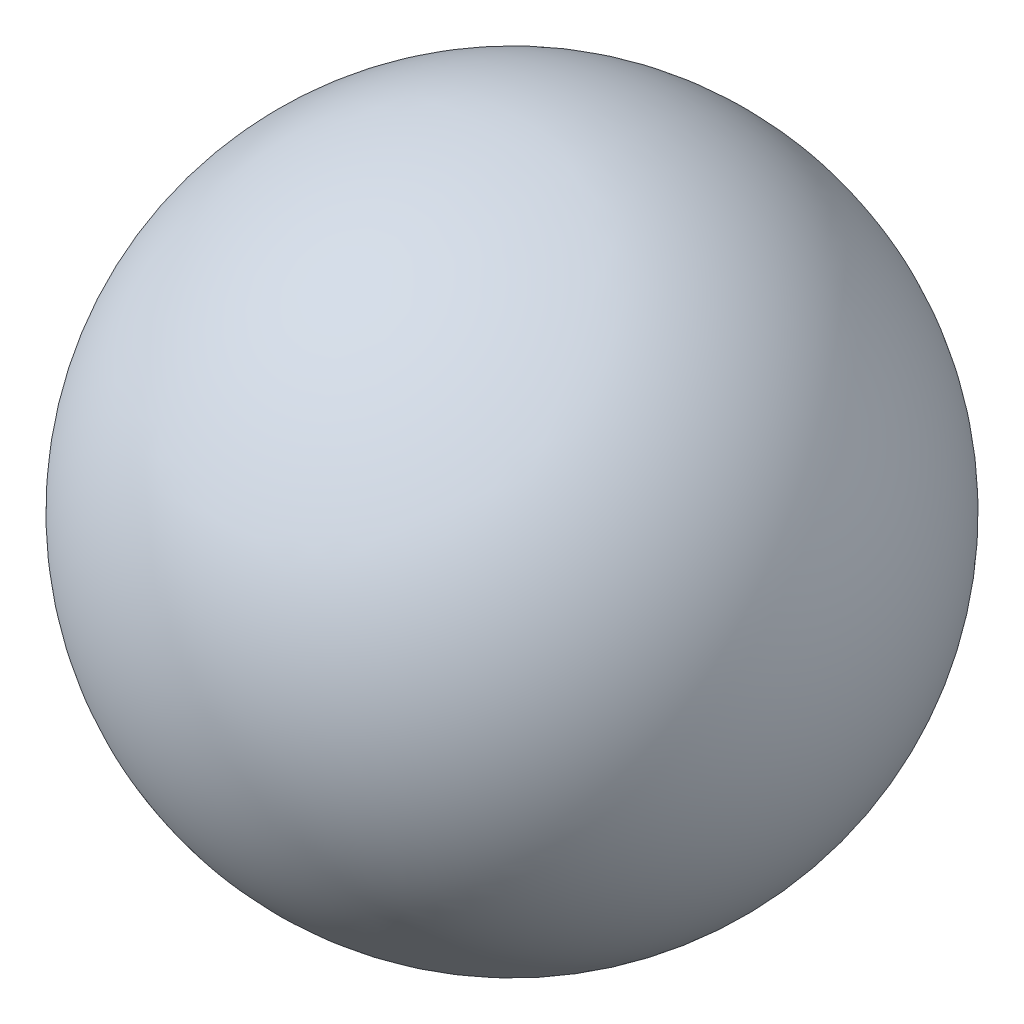
ISO-10303-21;
HEADER;
FILE_DESCRIPTION(('STEP AP214'),'2;1');
FILE_NAME('part.step','',(''),(''),'','','');
FILE_SCHEMA(('AUTOMOTIVE_DESIGN { 1 0 10303 214 1 1 1 1 }'));
ENDSEC;
DATA;
#1=APPLICATION_CONTEXT('core data for automotive mechanical design processes');
#2=APPLICATION_PROTOCOL_DEFINITION('international standard','automotive_design',2000,#1);
#3=PRODUCT_CONTEXT('',#1,'mechanical');
#4=PRODUCT('Part','Part','',(#3));
#5=PRODUCT_RELATED_PRODUCT_CATEGORY('part','',(#4));
#6=PRODUCT_DEFINITION_FORMATION('','',#4);
#7=PRODUCT_DEFINITION_CONTEXT('part definition',#1,'design');
#8=PRODUCT_DEFINITION('design','',#6,#7);
#9=PRODUCT_DEFINITION_SHAPE('','',#8);
#10=(LENGTH_UNIT() NAMED_UNIT(*) SI_UNIT(.MILLI.,.METRE.));
#11=(NAMED_UNIT(*) PLANE_ANGLE_UNIT() SI_UNIT($,.RADIAN.));
#12=(NAMED_UNIT(*) SI_UNIT($,.STERADIAN.) SOLID_ANGLE_UNIT());
#13=UNCERTAINTY_MEASURE_WITH_UNIT(LENGTH_MEASURE(1.E-05),#10,'distance_accuracy_value','');
#14=(GEOMETRIC_REPRESENTATION_CONTEXT(3) GLOBAL_UNCERTAINTY_ASSIGNED_CONTEXT((#13)) GLOBAL_UNIT_ASSIGNED_CONTEXT((#10,
#11,#12)) REPRESENTATION_CONTEXT('',''));
#15=CARTESIAN_POINT('',(0.,0.,0.));
#16=DIRECTION('',(0.,0.,1.));
#17=DIRECTION('',(1.,0.,0.));
#18=AXIS2_PLACEMENT_3D('',#15,#16,#17);
#19=CARTESIAN_POINT('',(67.76,19.2917414978071,-66.6100928255755));
#20=DIRECTION('',(0.,0.278189430012718,-0.960526231307193));
#21=DIRECTION('',(0.173648177666934,0.945933679562921,0.273963107482572));
#22=AXIS2_PLACEMENT_3D('',#19,#20,#21);
#23=SPHERICAL_SURFACE('',#22,7.15);
#24=CARTESIAN_POINT('',(67.76,17.3026870732162,-59.7423302717291));
#25=VERTEX_POINT('',#24);
#26=VERTEX_LOOP('',#25);
#27=FACE_BOUND('',#26,.T.);
#28=CARTESIAN_POINT('',(67.76,21.280795922398,-73.4778553794219));
#29=VERTEX_POINT('',#28);
#30=VERTEX_LOOP('',#29);
#31=FACE_BOUND('',#30,.T.);
#32=ADVANCED_FACE('F16',(#27,#31),#23,.T.);
#33=CLOSED_SHELL('',(#32));
#34=MANIFOLD_SOLID_BREP('B1',#33);
#35=ADVANCED_BREP_SHAPE_REPRESENTATION('',(#18,#34),#14);
#36=SHAPE_DEFINITION_REPRESENTATION(#9,#35);
ENDSEC;
END-ISO-10303-21;
